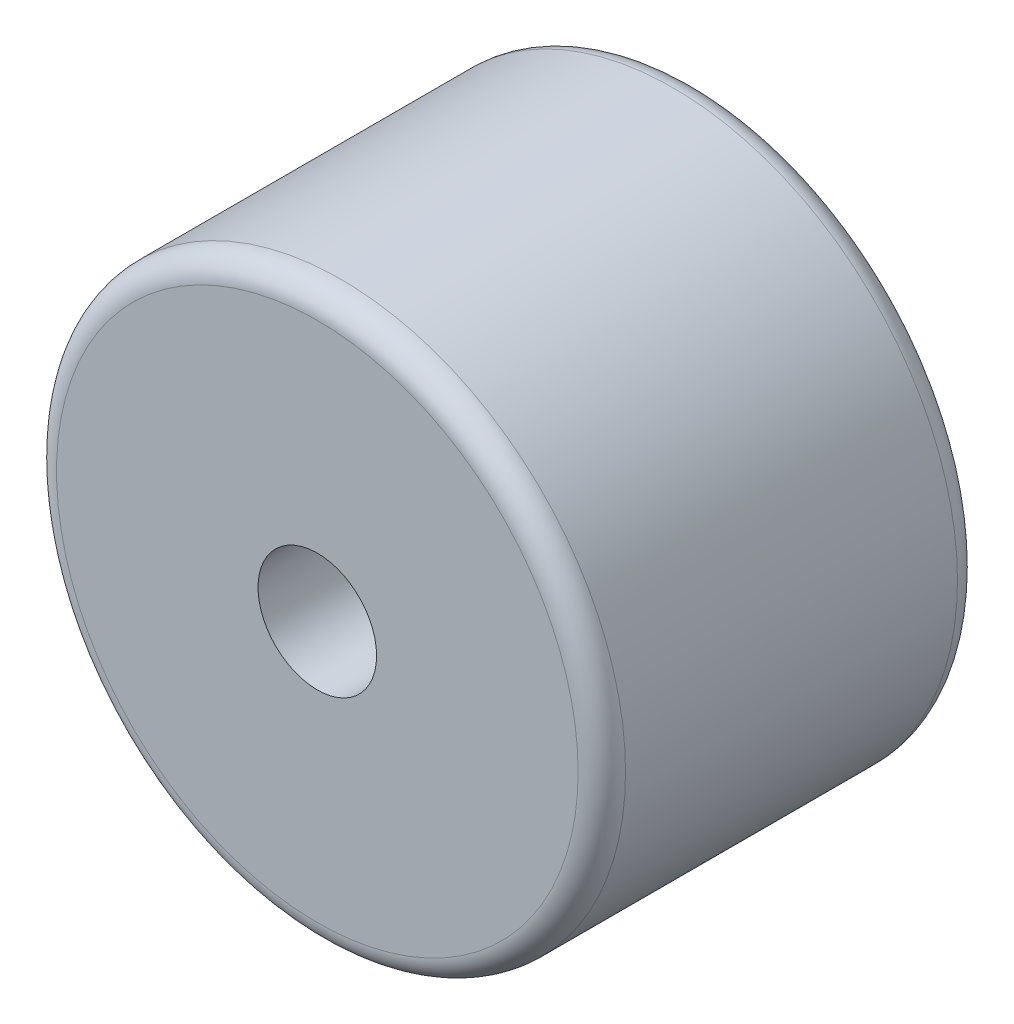
ISO-10303-21;
HEADER;
FILE_DESCRIPTION(('STEP AP214'),'2;1');
FILE_NAME('part.step','',(''),(''),'','','');
FILE_SCHEMA(('AUTOMOTIVE_DESIGN { 1 0 10303 214 1 1 1 1 }'));
ENDSEC;
DATA;
#1=APPLICATION_CONTEXT('core data for automotive mechanical design processes');
#2=APPLICATION_PROTOCOL_DEFINITION('international standard','automotive_design',2000,#1);
#3=PRODUCT_CONTEXT('',#1,'mechanical');
#4=PRODUCT('Part','Part','',(#3));
#5=PRODUCT_RELATED_PRODUCT_CATEGORY('part','',(#4));
#6=PRODUCT_DEFINITION_FORMATION('','',#4);
#7=PRODUCT_DEFINITION_CONTEXT('part definition',#1,'design');
#8=PRODUCT_DEFINITION('design','',#6,#7);
#9=PRODUCT_DEFINITION_SHAPE('','',#8);
#10=(LENGTH_UNIT() NAMED_UNIT(*) SI_UNIT(.MILLI.,.METRE.));
#11=(NAMED_UNIT(*) PLANE_ANGLE_UNIT() SI_UNIT($,.RADIAN.));
#12=(NAMED_UNIT(*) SI_UNIT($,.STERADIAN.) SOLID_ANGLE_UNIT());
#13=UNCERTAINTY_MEASURE_WITH_UNIT(LENGTH_MEASURE(1.E-05),#10,'distance_accuracy_value','');
#14=(GEOMETRIC_REPRESENTATION_CONTEXT(3) GLOBAL_UNCERTAINTY_ASSIGNED_CONTEXT((#13)) GLOBAL_UNIT_ASSIGNED_CONTEXT((#10,
#11,#12)) REPRESENTATION_CONTEXT('',''));
#15=CARTESIAN_POINT('',(0.,0.,0.));
#16=DIRECTION('',(0.,0.,1.));
#17=DIRECTION('',(1.,0.,0.));
#18=AXIS2_PLACEMENT_3D('',#15,#16,#17);
#19=CARTESIAN_POINT('',(0.,0.,16.));
#20=DIRECTION('',(0.,0.,-1.));
#21=DIRECTION('',(-1.,0.,0.));
#22=AXIS2_PLACEMENT_3D('',#19,#20,#21);
#23=CYLINDRICAL_SURFACE('',#22,12.);
#24=CARTESIAN_POINT('',(0.,0.,1.));
#25=DIRECTION('',(0.,0.,1.));
#26=DIRECTION('',(1.,0.,0.));
#27=AXIS2_PLACEMENT_3D('',#24,#25,#26);
#28=CIRCLE('',#27,12.);
#29=CARTESIAN_POINT('',(12.,0.,1.));
#30=VERTEX_POINT('',#29);
#31=EDGE_CURVE('E50',#30,#30,#28,.T.);
#32=ORIENTED_EDGE('',*,*,#31,.T.);
#33=EDGE_LOOP('',(#32));
#34=FACE_BOUND('',#33,.T.);
#35=CARTESIAN_POINT('',(0.,0.,15.));
#36=DIRECTION('',(0.,0.,1.));
#37=DIRECTION('',(1.,0.,0.));
#38=AXIS2_PLACEMENT_3D('',#35,#36,#37);
#39=CIRCLE('',#38,12.);
#40=CARTESIAN_POINT('',(12.,0.,15.));
#41=VERTEX_POINT('',#40);
#42=EDGE_CURVE('E54',#41,#41,#39,.F.);
#43=ORIENTED_EDGE('',*,*,#42,.T.);
#44=EDGE_LOOP('',(#43));
#45=FACE_BOUND('',#44,.T.);
#46=ADVANCED_FACE('F39',(#34,#45),#23,.T.);
#47=CARTESIAN_POINT('',(0.,0.,16.));
#48=DIRECTION('',(0.,0.,1.));
#49=DIRECTION('',(1.,0.,0.));
#50=AXIS2_PLACEMENT_3D('',#47,#48,#49);
#51=PLANE('',#50);
#52=CARTESIAN_POINT('',(0.,0.,16.));
#53=DIRECTION('',(0.,0.,1.));
#54=DIRECTION('',(1.,0.,0.));
#55=AXIS2_PLACEMENT_3D('',#52,#53,#54);
#56=CIRCLE('',#55,11.);
#57=CARTESIAN_POINT('',(11.,0.,16.));
#58=VERTEX_POINT('',#57);
#59=EDGE_CURVE('E10',#58,#58,#56,.T.);
#60=ORIENTED_EDGE('',*,*,#59,.T.);
#61=EDGE_LOOP('',(#60));
#62=FACE_BOUND('',#61,.T.);
#63=CARTESIAN_POINT('',(0.,0.,16.));
#64=DIRECTION('',(0.,0.,1.));
#65=DIRECTION('',(1.,0.,0.));
#66=AXIS2_PLACEMENT_3D('',#63,#64,#65);
#67=CIRCLE('',#66,2.5);
#68=CARTESIAN_POINT('',(2.5,0.,16.));
#69=VERTEX_POINT('',#68);
#70=EDGE_CURVE('E62',#69,#69,#67,.T.);
#71=ORIENTED_EDGE('',*,*,#70,.F.);
#72=EDGE_LOOP('',(#71));
#73=FACE_BOUND('',#72,.T.);
#74=ADVANCED_FACE('F69',(#62,#73),#51,.T.);
#75=CARTESIAN_POINT('',(0.,0.,0.));
#76=DIRECTION('',(0.,0.,1.));
#77=DIRECTION('',(1.,0.,0.));
#78=AXIS2_PLACEMENT_3D('',#75,#76,#77);
#79=PLANE('',#78);
#80=CARTESIAN_POINT('',(0.,0.,0.));
#81=DIRECTION('',(0.,0.,1.));
#82=DIRECTION('',(1.,0.,0.));
#83=AXIS2_PLACEMENT_3D('',#80,#81,#82);
#84=CIRCLE('',#83,11.);
#85=CARTESIAN_POINT('',(11.,0.,0.));
#86=VERTEX_POINT('',#85);
#87=EDGE_CURVE('E46',#86,#86,#84,.F.);
#88=ORIENTED_EDGE('',*,*,#87,.T.);
#89=EDGE_LOOP('',(#88));
#90=FACE_BOUND('',#89,.T.);
#91=CARTESIAN_POINT('',(0.,0.,0.));
#92=DIRECTION('',(0.,0.,1.));
#93=DIRECTION('',(1.,0.,0.));
#94=AXIS2_PLACEMENT_3D('',#91,#92,#93);
#95=CIRCLE('',#94,2.5);
#96=CARTESIAN_POINT('',(2.5,0.,0.));
#97=VERTEX_POINT('',#96);
#98=EDGE_CURVE('E59',#97,#97,#95,.T.);
#99=ORIENTED_EDGE('',*,*,#98,.T.);
#100=EDGE_LOOP('',(#99));
#101=FACE_BOUND('',#100,.T.);
#102=ADVANCED_FACE('F71',(#90,#101),#79,.F.);
#103=CARTESIAN_POINT('',(0.,0.,-14.));
#104=DIRECTION('',(0.,0.,1.));
#105=DIRECTION('',(1.,0.,0.));
#106=AXIS2_PLACEMENT_3D('',#103,#104,#105);
#107=CYLINDRICAL_SURFACE('',#106,2.5);
#108=ORIENTED_EDGE('',*,*,#70,.T.);
#109=EDGE_LOOP('',(#108));
#110=FACE_BOUND('',#109,.T.);
#111=ORIENTED_EDGE('',*,*,#98,.F.);
#112=EDGE_LOOP('',(#111));
#113=FACE_BOUND('',#112,.T.);
#114=ADVANCED_FACE('F66',(#110,#113),#107,.F.);
#115=CARTESIAN_POINT('',(0.,0.,1.));
#116=DIRECTION('',(0.,0.,1.));
#117=DIRECTION('',(1.,0.,0.));
#118=AXIS2_PLACEMENT_3D('',#115,#116,#117);
#119=TOROIDAL_SURFACE('',#118,11.,1.);
#120=ORIENTED_EDGE('',*,*,#87,.F.);
#121=EDGE_LOOP('',(#120));
#122=FACE_BOUND('',#121,.T.);
#123=ORIENTED_EDGE('',*,*,#31,.F.);
#124=EDGE_LOOP('',(#123));
#125=FACE_BOUND('',#124,.T.);
#126=ADVANCED_FACE('F81',(#122,#125),#119,.T.);
#127=CARTESIAN_POINT('',(0.,0.,15.));
#128=DIRECTION('',(0.,0.,1.));
#129=DIRECTION('',(1.,0.,0.));
#130=AXIS2_PLACEMENT_3D('',#127,#128,#129);
#131=TOROIDAL_SURFACE('',#130,11.,1.);
#132=ORIENTED_EDGE('',*,*,#42,.F.);
#133=EDGE_LOOP('',(#132));
#134=FACE_BOUND('',#133,.T.);
#135=ORIENTED_EDGE('',*,*,#59,.F.);
#136=EDGE_LOOP('',(#135));
#137=FACE_BOUND('',#136,.T.);
#138=ADVANCED_FACE('F41',(#134,#137),#131,.T.);
#139=CLOSED_SHELL('',(#46,#74,#102,#114,#126,#138));
#140=MANIFOLD_SOLID_BREP('B2',#139);
#141=ADVANCED_BREP_SHAPE_REPRESENTATION('',(#18,#140),#14);
#142=SHAPE_DEFINITION_REPRESENTATION(#9,#141);
ENDSEC;
END-ISO-10303-21;
